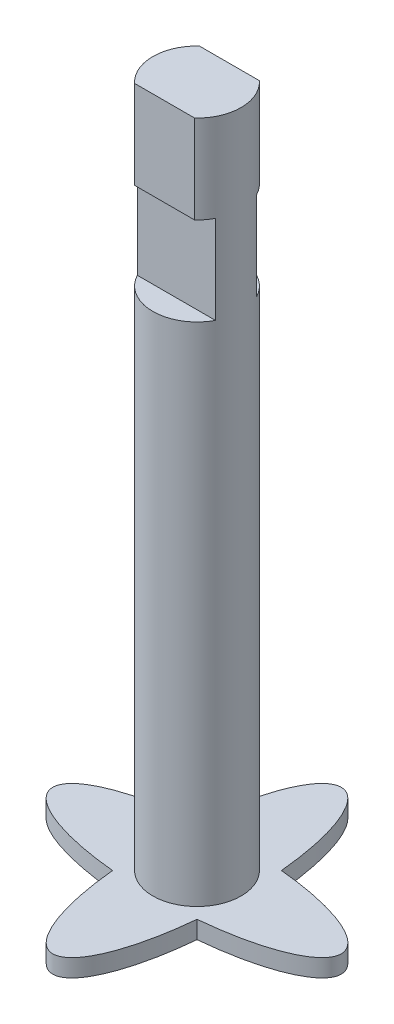
ISO-10303-21;
HEADER;
FILE_DESCRIPTION(('STEP AP214'),'2;1');
FILE_NAME('part.step','',(''),(''),'','','');
FILE_SCHEMA(('AUTOMOTIVE_DESIGN { 1 0 10303 214 1 1 1 1 }'));
ENDSEC;
DATA;
#1=APPLICATION_CONTEXT('core data for automotive mechanical design processes');
#2=APPLICATION_PROTOCOL_DEFINITION('international standard','automotive_design',2000,#1);
#3=PRODUCT_CONTEXT('',#1,'mechanical');
#4=PRODUCT('Part','Part','',(#3));
#5=PRODUCT_RELATED_PRODUCT_CATEGORY('part','',(#4));
#6=PRODUCT_DEFINITION_FORMATION('','',#4);
#7=PRODUCT_DEFINITION_CONTEXT('part definition',#1,'design');
#8=PRODUCT_DEFINITION('design','',#6,#7);
#9=PRODUCT_DEFINITION_SHAPE('','',#8);
#10=(LENGTH_UNIT() NAMED_UNIT(*) SI_UNIT(.MILLI.,.METRE.));
#11=(NAMED_UNIT(*) PLANE_ANGLE_UNIT() SI_UNIT($,.RADIAN.));
#12=(NAMED_UNIT(*) SI_UNIT($,.STERADIAN.) SOLID_ANGLE_UNIT());
#13=UNCERTAINTY_MEASURE_WITH_UNIT(LENGTH_MEASURE(1.E-05),#10,'distance_accuracy_value','');
#14=(GEOMETRIC_REPRESENTATION_CONTEXT(3) GLOBAL_UNCERTAINTY_ASSIGNED_CONTEXT((#13)) GLOBAL_UNIT_ASSIGNED_CONTEXT((#10,
#11,#12)) REPRESENTATION_CONTEXT('',''));
#15=CARTESIAN_POINT('',(0.,0.,0.));
#16=DIRECTION('',(0.,0.,1.));
#17=DIRECTION('',(1.,0.,0.));
#18=AXIS2_PLACEMENT_3D('',#15,#16,#17);
#19=CARTESIAN_POINT('',(0.,59.5,0.));
#20=DIRECTION('',(0.,-1.,0.));
#21=DIRECTION('',(0.,0.,-1.));
#22=AXIS2_PLACEMENT_3D('',#19,#20,#21);
#23=CYLINDRICAL_SURFACE('',#22,3.75);
#24=DIRECTION('',(0.,-1.,0.));
#25=VECTOR('',#24,1.);
#26=CARTESIAN_POINT('',(-2.54950975679639,59.5,-2.75));
#27=LINE('',#26,#25);
#28=CARTESIAN_POINT('',(-2.54950975679639,52.,-2.75));
#29=VERTEX_POINT('',#28);
#30=CARTESIAN_POINT('',(-2.54950975679639,59.5,-2.75));
#31=VERTEX_POINT('',#30);
#32=EDGE_CURVE('E53',#29,#31,#27,.F.);
#33=ORIENTED_EDGE('',*,*,#32,.F.);
#34=CARTESIAN_POINT('',(0.,52.,0.));
#35=DIRECTION('',(0.,1.,0.));
#36=DIRECTION('',(0.,0.,1.));
#37=AXIS2_PLACEMENT_3D('',#34,#35,#36);
#38=CIRCLE('',#37,3.75);
#39=CARTESIAN_POINT('',(-3.3166247903554,52.,-1.75));
#40=VERTEX_POINT('',#39);
#41=EDGE_CURVE('E148',#29,#40,#38,.T.);
#42=ORIENTED_EDGE('',*,*,#41,.T.);
#43=DIRECTION('',(0.,-1.,0.));
#44=VECTOR('',#43,1.);
#45=CARTESIAN_POINT('',(-3.3166247903554,59.5,-1.75));
#46=LINE('',#45,#44);
#47=CARTESIAN_POINT('',(-3.3166247903554,44.5,-1.75));
#48=VERTEX_POINT('',#47);
#49=EDGE_CURVE('E11',#40,#48,#46,.T.);
#50=ORIENTED_EDGE('',*,*,#49,.T.);
#51=CARTESIAN_POINT('',(0.,44.5,0.));
#52=DIRECTION('',(0.,-1.,0.));
#53=DIRECTION('',(0.,0.,-1.));
#54=AXIS2_PLACEMENT_3D('',#51,#52,#53);
#55=CIRCLE('',#54,3.75);
#56=CARTESIAN_POINT('',(3.3166247903554,44.5,-1.75));
#57=VERTEX_POINT('',#56);
#58=EDGE_CURVE('E129',#48,#57,#55,.T.);
#59=ORIENTED_EDGE('',*,*,#58,.T.);
#60=DIRECTION('',(0.,-1.,0.));
#61=VECTOR('',#60,1.);
#62=CARTESIAN_POINT('',(3.3166247903554,59.5,-1.75));
#63=LINE('',#62,#61);
#64=CARTESIAN_POINT('',(3.3166247903554,52.,-1.75));
#65=VERTEX_POINT('',#64);
#66=EDGE_CURVE('E46',#57,#65,#63,.F.);
#67=ORIENTED_EDGE('',*,*,#66,.T.);
#68=CARTESIAN_POINT('',(2.54950975679639,52.,-2.75));
#69=VERTEX_POINT('',#68);
#70=EDGE_CURVE('E152',#65,#69,#38,.T.);
#71=ORIENTED_EDGE('',*,*,#70,.T.);
#72=DIRECTION('',(0.,-1.,0.));
#73=VECTOR('',#72,1.);
#74=CARTESIAN_POINT('',(2.54950975679639,59.5,-2.75));
#75=LINE('',#74,#73);
#76=CARTESIAN_POINT('',(2.54950975679639,59.5,-2.75));
#77=VERTEX_POINT('',#76);
#78=EDGE_CURVE('E154',#77,#69,#75,.T.);
#79=ORIENTED_EDGE('',*,*,#78,.F.);
#80=CARTESIAN_POINT('',(0.,59.5,0.));
#81=DIRECTION('',(0.,1.,0.));
#82=DIRECTION('',(0.,0.,1.));
#83=AXIS2_PLACEMENT_3D('',#80,#81,#82);
#84=CIRCLE('',#83,3.75);
#85=CARTESIAN_POINT('',(2.54950975679639,59.5,2.75));
#86=VERTEX_POINT('',#85);
#87=EDGE_CURVE('E172',#86,#77,#84,.T.);
#88=ORIENTED_EDGE('',*,*,#87,.F.);
#89=DIRECTION('',(0.,-1.,0.));
#90=VECTOR('',#89,1.);
#91=CARTESIAN_POINT('',(2.54950975679639,59.5,2.75));
#92=LINE('',#91,#90);
#93=CARTESIAN_POINT('',(2.54950975679639,52.,2.75));
#94=VERTEX_POINT('',#93);
#95=EDGE_CURVE('E61',#94,#86,#92,.F.);
#96=ORIENTED_EDGE('',*,*,#95,.F.);
#97=CARTESIAN_POINT('',(0.,52.,0.));
#98=DIRECTION('',(0.,1.,0.));
#99=DIRECTION('',(0.,0.,1.));
#100=AXIS2_PLACEMENT_3D('',#97,#98,#99);
#101=CIRCLE('',#100,3.75);
#102=CARTESIAN_POINT('',(3.3166247903554,52.,1.75));
#103=VERTEX_POINT('',#102);
#104=EDGE_CURVE('E166',#94,#103,#101,.T.);
#105=ORIENTED_EDGE('',*,*,#104,.T.);
#106=DIRECTION('',(0.,-1.,0.));
#107=VECTOR('',#106,1.);
#108=CARTESIAN_POINT('',(3.3166247903554,59.5,1.75));
#109=LINE('',#108,#107);
#110=CARTESIAN_POINT('',(3.3166247903554,44.5,1.75));
#111=VERTEX_POINT('',#110);
#112=EDGE_CURVE('E235',#103,#111,#109,.T.);
#113=ORIENTED_EDGE('',*,*,#112,.T.);
#114=CARTESIAN_POINT('',(0.,44.5,0.));
#115=DIRECTION('',(0.,-1.,0.));
#116=DIRECTION('',(0.,0.,-1.));
#117=AXIS2_PLACEMENT_3D('',#114,#115,#116);
#118=CIRCLE('',#117,3.75);
#119=CARTESIAN_POINT('',(-3.3166247903554,44.5,1.75));
#120=VERTEX_POINT('',#119);
#121=EDGE_CURVE('E228',#111,#120,#118,.T.);
#122=ORIENTED_EDGE('',*,*,#121,.T.);
#123=DIRECTION('',(0.,-1.,0.));
#124=VECTOR('',#123,1.);
#125=CARTESIAN_POINT('',(-3.3166247903554,59.5,1.75));
#126=LINE('',#125,#124);
#127=CARTESIAN_POINT('',(-3.3166247903554,52.,1.75));
#128=VERTEX_POINT('',#127);
#129=EDGE_CURVE('E232',#120,#128,#126,.F.);
#130=ORIENTED_EDGE('',*,*,#129,.T.);
#131=CARTESIAN_POINT('',(-2.54950975679639,52.,2.75));
#132=VERTEX_POINT('',#131);
#133=EDGE_CURVE('E163',#128,#132,#101,.T.);
#134=ORIENTED_EDGE('',*,*,#133,.T.);
#135=DIRECTION('',(0.,-1.,0.));
#136=VECTOR('',#135,1.);
#137=CARTESIAN_POINT('',(-2.54950975679639,59.5,2.75));
#138=LINE('',#137,#136);
#139=CARTESIAN_POINT('',(-2.54950975679639,59.5,2.75));
#140=VERTEX_POINT('',#139);
#141=EDGE_CURVE('E168',#140,#132,#138,.T.);
#142=ORIENTED_EDGE('',*,*,#141,.F.);
#143=EDGE_CURVE('E176',#31,#140,#84,.T.);
#144=ORIENTED_EDGE('',*,*,#143,.F.);
#145=EDGE_LOOP('',(#33,#42,#50,#59,#67,#71,#79,#88,#96,#105,#113,#122,#130,#134,#142,#144));
#146=FACE_BOUND('',#145,.T.);
#147=CARTESIAN_POINT('',(0.,1.5,0.));
#148=DIRECTION('',(0.,1.,0.));
#149=DIRECTION('',(0.,0.,1.));
#150=AXIS2_PLACEMENT_3D('',#147,#148,#149);
#151=CIRCLE('',#150,3.75);
#152=CARTESIAN_POINT('',(0.,1.5,3.75));
#153=VERTEX_POINT('',#152);
#154=EDGE_CURVE('E171',#153,#153,#151,.T.);
#155=ORIENTED_EDGE('',*,*,#154,.T.);
#156=EDGE_LOOP('',(#155));
#157=FACE_BOUND('',#156,.T.);
#158=ADVANCED_FACE('F37',(#146,#157),#23,.T.);
#159=CARTESIAN_POINT('',(0.,59.5,0.));
#160=DIRECTION('',(0.,1.,0.));
#161=DIRECTION('',(0.,0.,1.));
#162=AXIS2_PLACEMENT_3D('',#159,#160,#161);
#163=PLANE('',#162);
#164=ORIENTED_EDGE('',*,*,#87,.T.);
#165=DIRECTION('',(-1.,0.,0.));
#166=VECTOR('',#165,1.);
#167=CARTESIAN_POINT('',(0.,59.5,-2.75));
#168=LINE('',#167,#166);
#169=EDGE_CURVE('E138',#77,#31,#168,.T.);
#170=ORIENTED_EDGE('',*,*,#169,.T.);
#171=ORIENTED_EDGE('',*,*,#143,.T.);
#172=DIRECTION('',(1.,0.,0.));
#173=VECTOR('',#172,1.);
#174=CARTESIAN_POINT('',(0.,59.5,2.75));
#175=LINE('',#174,#173);
#176=EDGE_CURVE('E226',#140,#86,#175,.T.);
#177=ORIENTED_EDGE('',*,*,#176,.T.);
#178=EDGE_LOOP('',(#164,#170,#171,#177));
#179=FACE_BOUND('',#178,.T.);
#180=ADVANCED_FACE('F246',(#179),#163,.T.);
#181=CARTESIAN_POINT('',(0.,1.5,0.));
#182=DIRECTION('',(0.,1.,0.));
#183=DIRECTION('',(1.,0.,0.));
#184=AXIS2_PLACEMENT_3D('',#181,#182,#183);
#185=ELLIPSE('',#184,12.25,3.75);
#186=DIRECTION('',(0.,-1.,0.));
#187=VECTOR('',#186,1.);
#188=SURFACE_OF_LINEAR_EXTRUSION('',#185,#187);
#189=CARTESIAN_POINT('',(0.,0.,0.));
#190=DIRECTION('',(0.,1.,0.));
#191=DIRECTION('',(1.,0.,0.));
#192=AXIS2_PLACEMENT_3D('',#189,#190,#191);
#193=ELLIPSE('',#192,12.25,3.75);
#194=CARTESIAN_POINT('',(-3.58574983315287,0.,-3.58574983315287));
#195=VERTEX_POINT('',#194);
#196=CARTESIAN_POINT('',(-3.58574983315287,0.,3.58574983315287));
#197=VERTEX_POINT('',#196);
#198=EDGE_CURVE('E175',#195,#197,#193,.T.);
#199=ORIENTED_EDGE('',*,*,#198,.T.);
#200=DIRECTION('',(0.,-1.,0.));
#201=VECTOR('',#200,1.);
#202=CARTESIAN_POINT('',(-3.58574983315287,1.5,3.58574983315287));
#203=LINE('',#202,#201);
#204=CARTESIAN_POINT('',(-3.58574983315287,1.5,3.58574983315287));
#205=VERTEX_POINT('',#204);
#206=EDGE_CURVE('E223',#205,#197,#203,.T.);
#207=ORIENTED_EDGE('',*,*,#206,.F.);
#208=CARTESIAN_POINT('',(-3.58574983315287,1.5,-3.58574983315287));
#209=VERTEX_POINT('',#208);
#210=EDGE_CURVE('E178',#209,#205,#185,.T.);
#211=ORIENTED_EDGE('',*,*,#210,.F.);
#212=DIRECTION('',(0.,-1.,0.));
#213=VECTOR('',#212,1.);
#214=CARTESIAN_POINT('',(-3.58574983315287,1.5,-3.58574983315287));
#215=LINE('',#214,#213);
#216=EDGE_CURVE('E207',#209,#195,#215,.T.);
#217=ORIENTED_EDGE('',*,*,#216,.T.);
#218=EDGE_LOOP('',(#199,#207,#211,#217));
#219=FACE_BOUND('',#218,.T.);
#220=ADVANCED_FACE('F39',(#219),#188,.F.);
#221=CARTESIAN_POINT('',(0.,1.5,0.));
#222=DIRECTION('',(0.,1.,0.));
#223=DIRECTION('',(0.,0.,-1.));
#224=AXIS2_PLACEMENT_3D('',#221,#222,#223);
#225=ELLIPSE('',#224,12.25,3.75);
#226=DIRECTION('',(0.,-1.,0.));
#227=VECTOR('',#226,1.);
#228=SURFACE_OF_LINEAR_EXTRUSION('',#225,#227);
#229=CARTESIAN_POINT('',(0.,0.,0.));
#230=DIRECTION('',(0.,1.,0.));
#231=DIRECTION('',(0.,0.,-1.));
#232=AXIS2_PLACEMENT_3D('',#229,#230,#231);
#233=ELLIPSE('',#232,12.25,3.75);
#234=CARTESIAN_POINT('',(3.58574983315287,0.,3.58574983315287));
#235=VERTEX_POINT('',#234);
#236=EDGE_CURVE('E210',#197,#235,#233,.T.);
#237=ORIENTED_EDGE('',*,*,#236,.T.);
#238=DIRECTION('',(0.,-1.,0.));
#239=VECTOR('',#238,1.);
#240=CARTESIAN_POINT('',(3.58574983315287,1.5,3.58574983315287));
#241=LINE('',#240,#239);
#242=CARTESIAN_POINT('',(3.58574983315287,1.5,3.58574983315287));
#243=VERTEX_POINT('',#242);
#244=EDGE_CURVE('E220',#243,#235,#241,.T.);
#245=ORIENTED_EDGE('',*,*,#244,.F.);
#246=EDGE_CURVE('E182',#205,#243,#225,.T.);
#247=ORIENTED_EDGE('',*,*,#246,.F.);
#248=ORIENTED_EDGE('',*,*,#206,.T.);
#249=EDGE_LOOP('',(#237,#245,#247,#248));
#250=FACE_BOUND('',#249,.T.);
#251=ADVANCED_FACE('F189',(#250),#228,.F.);
#252=CARTESIAN_POINT('',(0.,1.5,0.));
#253=DIRECTION('',(0.,1.,0.));
#254=DIRECTION('',(1.,0.,0.));
#255=AXIS2_PLACEMENT_3D('',#252,#253,#254);
#256=ELLIPSE('',#255,12.25,3.75);
#257=DIRECTION('',(0.,-1.,0.));
#258=VECTOR('',#257,1.);
#259=SURFACE_OF_LINEAR_EXTRUSION('',#256,#258);
#260=CARTESIAN_POINT('',(0.,0.,0.));
#261=DIRECTION('',(0.,1.,0.));
#262=DIRECTION('',(1.,0.,0.));
#263=AXIS2_PLACEMENT_3D('',#260,#261,#262);
#264=ELLIPSE('',#263,12.25,3.75);
#265=CARTESIAN_POINT('',(3.58574983315287,0.,-3.58574983315287));
#266=VERTEX_POINT('',#265);
#267=EDGE_CURVE('E212',#235,#266,#264,.T.);
#268=ORIENTED_EDGE('',*,*,#267,.T.);
#269=DIRECTION('',(0.,-1.,0.));
#270=VECTOR('',#269,1.);
#271=CARTESIAN_POINT('',(3.58574983315287,1.5,-3.58574983315287));
#272=LINE('',#271,#270);
#273=CARTESIAN_POINT('',(3.58574983315287,1.5,-3.58574983315287));
#274=VERTEX_POINT('',#273);
#275=EDGE_CURVE('E217',#274,#266,#272,.T.);
#276=ORIENTED_EDGE('',*,*,#275,.F.);
#277=EDGE_CURVE('E186',#243,#274,#256,.T.);
#278=ORIENTED_EDGE('',*,*,#277,.F.);
#279=ORIENTED_EDGE('',*,*,#244,.T.);
#280=EDGE_LOOP('',(#268,#276,#278,#279));
#281=FACE_BOUND('',#280,.T.);
#282=ADVANCED_FACE('F192',(#281),#259,.F.);
#283=CARTESIAN_POINT('',(0.,1.5,0.));
#284=DIRECTION('',(0.,1.,0.));
#285=DIRECTION('',(0.,0.,-1.));
#286=AXIS2_PLACEMENT_3D('',#283,#284,#285);
#287=ELLIPSE('',#286,12.25,3.75);
#288=DIRECTION('',(0.,-1.,0.));
#289=VECTOR('',#288,1.);
#290=SURFACE_OF_LINEAR_EXTRUSION('',#287,#289);
#291=CARTESIAN_POINT('',(0.,0.,0.));
#292=DIRECTION('',(0.,1.,0.));
#293=DIRECTION('',(0.,0.,-1.));
#294=AXIS2_PLACEMENT_3D('',#291,#292,#293);
#295=ELLIPSE('',#294,12.25,3.75);
#296=EDGE_CURVE('E183',#266,#195,#295,.T.);
#297=ORIENTED_EDGE('',*,*,#296,.T.);
#298=ORIENTED_EDGE('',*,*,#216,.F.);
#299=EDGE_CURVE('E204',#274,#209,#287,.T.);
#300=ORIENTED_EDGE('',*,*,#299,.F.);
#301=ORIENTED_EDGE('',*,*,#275,.T.);
#302=EDGE_LOOP('',(#297,#298,#300,#301));
#303=FACE_BOUND('',#302,.T.);
#304=ADVANCED_FACE('F196',(#303),#290,.F.);
#305=CARTESIAN_POINT('',(0.,1.5,0.));
#306=DIRECTION('',(0.,1.,0.));
#307=DIRECTION('',(0.,0.,1.));
#308=AXIS2_PLACEMENT_3D('',#305,#306,#307);
#309=PLANE('',#308);
#310=ORIENTED_EDGE('',*,*,#154,.F.);
#311=EDGE_LOOP('',(#310));
#312=FACE_BOUND('',#311,.T.);
#313=ORIENTED_EDGE('',*,*,#210,.T.);
#314=ORIENTED_EDGE('',*,*,#246,.T.);
#315=ORIENTED_EDGE('',*,*,#277,.T.);
#316=ORIENTED_EDGE('',*,*,#299,.T.);
#317=EDGE_LOOP('',(#313,#314,#315,#316));
#318=FACE_BOUND('',#317,.T.);
#319=ADVANCED_FACE('F200',(#312,#318),#309,.T.);
#320=CARTESIAN_POINT('',(0.,0.,0.));
#321=DIRECTION('',(0.,1.,0.));
#322=DIRECTION('',(0.,0.,1.));
#323=AXIS2_PLACEMENT_3D('',#320,#321,#322);
#324=PLANE('',#323);
#325=ORIENTED_EDGE('',*,*,#198,.F.);
#326=ORIENTED_EDGE('',*,*,#296,.F.);
#327=ORIENTED_EDGE('',*,*,#267,.F.);
#328=ORIENTED_EDGE('',*,*,#236,.F.);
#329=EDGE_LOOP('',(#325,#326,#327,#328));
#330=FACE_BOUND('',#329,.T.);
#331=ADVANCED_FACE('F202',(#330),#324,.F.);
#332=CARTESIAN_POINT('',(-3.75,44.5,2.75));
#333=DIRECTION('',(0.,-1.,0.));
#334=DIRECTION('',(0.,0.,-1.));
#335=AXIS2_PLACEMENT_3D('',#332,#333,#334);
#336=PLANE('',#335);
#337=ORIENTED_EDGE('',*,*,#121,.F.);
#338=DIRECTION('',(1.,0.,0.));
#339=VECTOR('',#338,1.);
#340=CARTESIAN_POINT('',(-6.09801473471805,44.5,1.75));
#341=LINE('',#340,#339);
#342=EDGE_CURVE('E157',#120,#111,#341,.T.);
#343=ORIENTED_EDGE('',*,*,#342,.F.);
#344=EDGE_LOOP('',(#337,#343));
#345=FACE_BOUND('',#344,.T.);
#346=ADVANCED_FACE('F258',(#345),#336,.F.);
#347=CARTESIAN_POINT('',(0.,0.,2.75));
#348=DIRECTION('',(0.,0.,1.));
#349=DIRECTION('',(1.,0.,0.));
#350=AXIS2_PLACEMENT_3D('',#347,#348,#349);
#351=PLANE('',#350);
#352=DIRECTION('',(-1.,0.,0.));
#353=VECTOR('',#352,1.);
#354=CARTESIAN_POINT('',(0.,52.,2.75));
#355=LINE('',#354,#353);
#356=EDGE_CURVE('E230',#94,#132,#355,.T.);
#357=ORIENTED_EDGE('',*,*,#356,.F.);
#358=ORIENTED_EDGE('',*,*,#95,.T.);
#359=ORIENTED_EDGE('',*,*,#176,.F.);
#360=ORIENTED_EDGE('',*,*,#141,.T.);
#361=EDGE_LOOP('',(#357,#358,#359,#360));
#362=FACE_BOUND('',#361,.T.);
#363=ADVANCED_FACE('F248',(#362),#351,.T.);
#364=CARTESIAN_POINT('',(0.,0.,1.75));
#365=DIRECTION('',(0.,0.,-1.));
#366=DIRECTION('',(-1.,0.,0.));
#367=AXIS2_PLACEMENT_3D('',#364,#365,#366);
#368=PLANE('',#367);
#369=DIRECTION('',(-1.,0.,0.));
#370=VECTOR('',#369,1.);
#371=CARTESIAN_POINT('',(-6.09801473471805,52.,1.75));
#372=LINE('',#371,#370);
#373=EDGE_CURVE('E160',#103,#128,#372,.T.);
#374=ORIENTED_EDGE('',*,*,#373,.T.);
#375=ORIENTED_EDGE('',*,*,#129,.F.);
#376=ORIENTED_EDGE('',*,*,#342,.T.);
#377=ORIENTED_EDGE('',*,*,#112,.F.);
#378=EDGE_LOOP('',(#374,#375,#376,#377));
#379=FACE_BOUND('',#378,.T.);
#380=ADVANCED_FACE('F255',(#379),#368,.F.);
#381=CARTESIAN_POINT('',(-6.09801473471805,52.,1.75));
#382=DIRECTION('',(0.,1.,0.));
#383=DIRECTION('',(0.,0.,1.));
#384=AXIS2_PLACEMENT_3D('',#381,#382,#383);
#385=PLANE('',#384);
#386=ORIENTED_EDGE('',*,*,#356,.T.);
#387=ORIENTED_EDGE('',*,*,#133,.F.);
#388=ORIENTED_EDGE('',*,*,#373,.F.);
#389=ORIENTED_EDGE('',*,*,#104,.F.);
#390=EDGE_LOOP('',(#386,#387,#388,#389));
#391=FACE_BOUND('',#390,.T.);
#392=ADVANCED_FACE('F252',(#391),#385,.F.);
#393=CARTESIAN_POINT('',(3.75,44.5,-2.75));
#394=DIRECTION('',(0.,-1.,0.));
#395=DIRECTION('',(0.,0.,-1.));
#396=AXIS2_PLACEMENT_3D('',#393,#394,#395);
#397=PLANE('',#396);
#398=ORIENTED_EDGE('',*,*,#58,.F.);
#399=DIRECTION('',(-1.,0.,0.));
#400=VECTOR('',#399,1.);
#401=CARTESIAN_POINT('',(6.09801473471805,44.5,-1.75));
#402=LINE('',#401,#400);
#403=EDGE_CURVE('E143',#57,#48,#402,.T.);
#404=ORIENTED_EDGE('',*,*,#403,.F.);
#405=EDGE_LOOP('',(#398,#404));
#406=FACE_BOUND('',#405,.T.);
#407=ADVANCED_FACE('F146',(#406),#397,.F.);
#408=CARTESIAN_POINT('',(0.,0.,-2.75));
#409=DIRECTION('',(0.,0.,-1.));
#410=DIRECTION('',(-1.,0.,0.));
#411=AXIS2_PLACEMENT_3D('',#408,#409,#410);
#412=PLANE('',#411);
#413=DIRECTION('',(1.,0.,0.));
#414=VECTOR('',#413,1.);
#415=CARTESIAN_POINT('',(0.,52.,-2.75));
#416=LINE('',#415,#414);
#417=EDGE_CURVE('E137',#29,#69,#416,.T.);
#418=ORIENTED_EDGE('',*,*,#417,.F.);
#419=ORIENTED_EDGE('',*,*,#32,.T.);
#420=ORIENTED_EDGE('',*,*,#169,.F.);
#421=ORIENTED_EDGE('',*,*,#78,.T.);
#422=EDGE_LOOP('',(#418,#419,#420,#421));
#423=FACE_BOUND('',#422,.T.);
#424=ADVANCED_FACE('F243',(#423),#412,.T.);
#425=CARTESIAN_POINT('',(0.,0.,-1.75));
#426=DIRECTION('',(0.,0.,1.));
#427=DIRECTION('',(1.,0.,0.));
#428=AXIS2_PLACEMENT_3D('',#425,#426,#427);
#429=PLANE('',#428);
#430=DIRECTION('',(1.,0.,0.));
#431=VECTOR('',#430,1.);
#432=CARTESIAN_POINT('',(6.09801473471805,52.,-1.75));
#433=LINE('',#432,#431);
#434=EDGE_CURVE('E145',#40,#65,#433,.T.);
#435=ORIENTED_EDGE('',*,*,#434,.T.);
#436=ORIENTED_EDGE('',*,*,#66,.F.);
#437=ORIENTED_EDGE('',*,*,#403,.T.);
#438=ORIENTED_EDGE('',*,*,#49,.F.);
#439=EDGE_LOOP('',(#435,#436,#437,#438));
#440=FACE_BOUND('',#439,.T.);
#441=ADVANCED_FACE('F142',(#440),#429,.F.);
#442=CARTESIAN_POINT('',(6.09801473471805,52.,-1.75));
#443=DIRECTION('',(0.,1.,0.));
#444=DIRECTION('',(0.,0.,1.));
#445=AXIS2_PLACEMENT_3D('',#442,#443,#444);
#446=PLANE('',#445);
#447=ORIENTED_EDGE('',*,*,#434,.F.);
#448=ORIENTED_EDGE('',*,*,#41,.F.);
#449=ORIENTED_EDGE('',*,*,#417,.T.);
#450=ORIENTED_EDGE('',*,*,#70,.F.);
#451=EDGE_LOOP('',(#447,#448,#449,#450));
#452=FACE_BOUND('',#451,.T.);
#453=ADVANCED_FACE('F240',(#452),#446,.F.);
#454=CLOSED_SHELL('',(#158,#180,#220,#251,#282,#304,#319,#331,#346,#363,#380,#392,#407,#424,
#441,#453));
#455=MANIFOLD_SOLID_BREP('B2',#454);
#456=ADVANCED_BREP_SHAPE_REPRESENTATION('',(#18,#455),#14);
#457=SHAPE_DEFINITION_REPRESENTATION(#9,#456);
ENDSEC;
END-ISO-10303-21;
